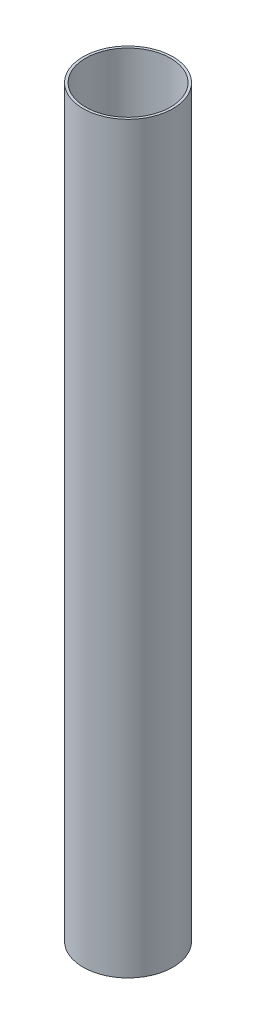
ISO-10303-21;
HEADER;
FILE_DESCRIPTION(('STEP AP214'),'2;1');
FILE_NAME('part.step','',(''),(''),'','','');
FILE_SCHEMA(('AUTOMOTIVE_DESIGN { 1 0 10303 214 1 1 1 1 }'));
ENDSEC;
DATA;
#1=APPLICATION_CONTEXT('core data for automotive mechanical design processes');
#2=APPLICATION_PROTOCOL_DEFINITION('international standard','automotive_design',2000,#1);
#3=PRODUCT_CONTEXT('',#1,'mechanical');
#4=PRODUCT('Part','Part','',(#3));
#5=PRODUCT_RELATED_PRODUCT_CATEGORY('part','',(#4));
#6=PRODUCT_DEFINITION_FORMATION('','',#4);
#7=PRODUCT_DEFINITION_CONTEXT('part definition',#1,'design');
#8=PRODUCT_DEFINITION('design','',#6,#7);
#9=PRODUCT_DEFINITION_SHAPE('','',#8);
#10=(LENGTH_UNIT() NAMED_UNIT(*) SI_UNIT(.MILLI.,.METRE.));
#11=(NAMED_UNIT(*) PLANE_ANGLE_UNIT() SI_UNIT($,.RADIAN.));
#12=(NAMED_UNIT(*) SI_UNIT($,.STERADIAN.) SOLID_ANGLE_UNIT());
#13=UNCERTAINTY_MEASURE_WITH_UNIT(LENGTH_MEASURE(1.E-05),#10,'distance_accuracy_value','');
#14=(GEOMETRIC_REPRESENTATION_CONTEXT(3) GLOBAL_UNCERTAINTY_ASSIGNED_CONTEXT((#13)) GLOBAL_UNIT_ASSIGNED_CONTEXT((#10,
#11,#12)) REPRESENTATION_CONTEXT('',''));
#15=CARTESIAN_POINT('',(0.,0.,0.));
#16=DIRECTION('',(0.,0.,1.));
#17=DIRECTION('',(1.,0.,0.));
#18=AXIS2_PLACEMENT_3D('',#15,#16,#17);
#19=CARTESIAN_POINT('',(0.,0.,0.));
#20=DIRECTION('',(0.,1.,0.));
#21=DIRECTION('',(0.,0.,1.));
#22=AXIS2_PLACEMENT_3D('',#19,#20,#21);
#23=PLANE('',#22);
#24=CARTESIAN_POINT('',(0.,0.,0.));
#25=DIRECTION('',(0.,-1.,0.));
#26=DIRECTION('',(0.,0.,-1.));
#27=AXIS2_PLACEMENT_3D('',#24,#25,#26);
#28=CIRCLE('',#27,14.5);
#29=CARTESIAN_POINT('',(0.,0.,-14.5));
#30=VERTEX_POINT('',#29);
#31=EDGE_CURVE('E10',#30,#30,#28,.T.);
#32=ORIENTED_EDGE('',*,*,#31,.F.);
#33=EDGE_LOOP('',(#32));
#34=FACE_BOUND('',#33,.T.);
#35=CARTESIAN_POINT('',(0.,0.,0.));
#36=DIRECTION('',(0.,-1.,0.));
#37=DIRECTION('',(0.,0.,-1.));
#38=AXIS2_PLACEMENT_3D('',#35,#36,#37);
#39=CIRCLE('',#38,15.35);
#40=CARTESIAN_POINT('',(0.,0.,-15.35));
#41=VERTEX_POINT('',#40);
#42=EDGE_CURVE('E59',#41,#41,#39,.T.);
#43=ORIENTED_EDGE('',*,*,#42,.T.);
#44=EDGE_LOOP('',(#43));
#45=FACE_BOUND('',#44,.T.);
#46=ADVANCED_FACE('F45',(#34,#45),#23,.F.);
#47=CARTESIAN_POINT('',(0.,0.,0.));
#48=DIRECTION('',(0.,-1.,0.));
#49=DIRECTION('',(0.,0.,-1.));
#50=AXIS2_PLACEMENT_3D('',#47,#48,#49);
#51=CYLINDRICAL_SURFACE('',#50,14.5);
#52=CARTESIAN_POINT('',(0.,254.,0.));
#53=DIRECTION('',(0.,-1.,0.));
#54=DIRECTION('',(0.,0.,-1.));
#55=AXIS2_PLACEMENT_3D('',#52,#53,#54);
#56=CIRCLE('',#55,14.5);
#57=CARTESIAN_POINT('',(0.,254.,-14.5));
#58=VERTEX_POINT('',#57);
#59=EDGE_CURVE('E51',#58,#58,#56,.T.);
#60=ORIENTED_EDGE('',*,*,#59,.F.);
#61=EDGE_LOOP('',(#60));
#62=FACE_BOUND('',#61,.T.);
#63=ORIENTED_EDGE('',*,*,#31,.T.);
#64=EDGE_LOOP('',(#63));
#65=FACE_BOUND('',#64,.T.);
#66=ADVANCED_FACE('F74',(#62,#65),#51,.F.);
#67=CARTESIAN_POINT('',(0.,254.,0.));
#68=DIRECTION('',(0.,1.,0.));
#69=DIRECTION('',(0.,0.,1.));
#70=AXIS2_PLACEMENT_3D('',#67,#68,#69);
#71=PLANE('',#70);
#72=ORIENTED_EDGE('',*,*,#59,.T.);
#73=EDGE_LOOP('',(#72));
#74=FACE_BOUND('',#73,.T.);
#75=CARTESIAN_POINT('',(0.,254.,0.));
#76=DIRECTION('',(0.,-1.,0.));
#77=DIRECTION('',(0.,0.,-1.));
#78=AXIS2_PLACEMENT_3D('',#75,#76,#77);
#79=CIRCLE('',#78,15.35);
#80=CARTESIAN_POINT('',(0.,254.,-15.35));
#81=VERTEX_POINT('',#80);
#82=EDGE_CURVE('E55',#81,#81,#79,.T.);
#83=ORIENTED_EDGE('',*,*,#82,.F.);
#84=EDGE_LOOP('',(#83));
#85=FACE_BOUND('',#84,.T.);
#86=ADVANCED_FACE('F68',(#74,#85),#71,.T.);
#87=CARTESIAN_POINT('',(0.,0.,0.));
#88=DIRECTION('',(0.,-1.,0.));
#89=DIRECTION('',(0.,0.,-1.));
#90=AXIS2_PLACEMENT_3D('',#87,#88,#89);
#91=CYLINDRICAL_SURFACE('',#90,15.35);
#92=ORIENTED_EDGE('',*,*,#82,.T.);
#93=EDGE_LOOP('',(#92));
#94=FACE_BOUND('',#93,.T.);
#95=ORIENTED_EDGE('',*,*,#42,.F.);
#96=EDGE_LOOP('',(#95));
#97=FACE_BOUND('',#96,.T.);
#98=ADVANCED_FACE('F66',(#94,#97),#91,.T.);
#99=CLOSED_SHELL('',(#46,#66,#86,#98));
#100=MANIFOLD_SOLID_BREP('B2',#99);
#101=ADVANCED_BREP_SHAPE_REPRESENTATION('',(#18,#100),#14);
#102=SHAPE_DEFINITION_REPRESENTATION(#9,#101);
ENDSEC;
END-ISO-10303-21;
